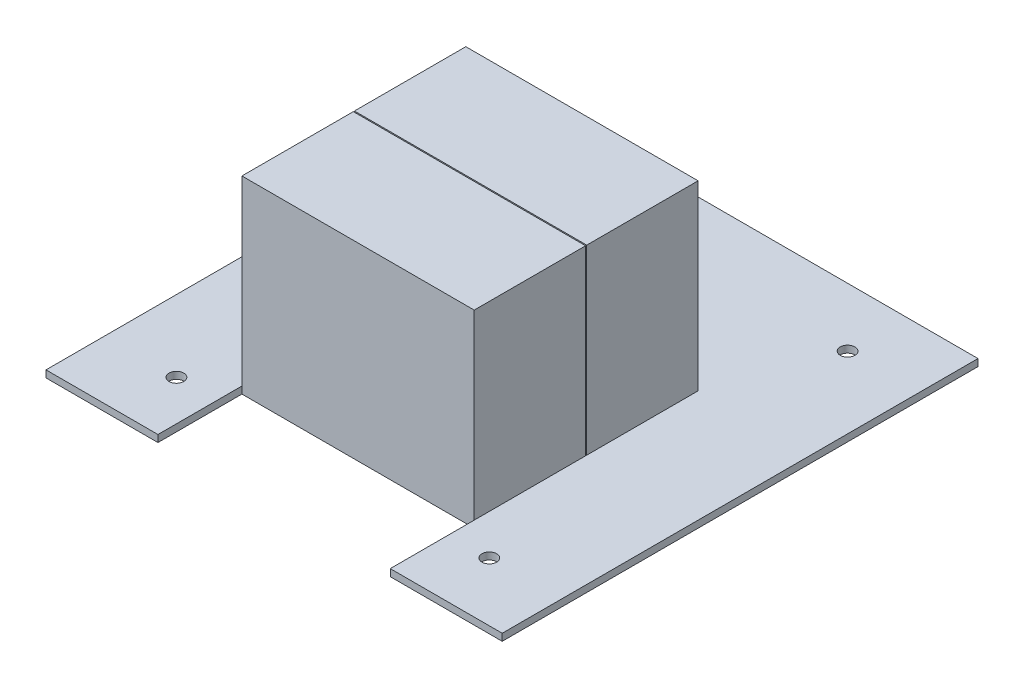
ISO-10303-21;
HEADER;
FILE_DESCRIPTION(('STEP AP214'),'2;1');
FILE_NAME('part.step','',(''),(''),'','','');
FILE_SCHEMA(('AUTOMOTIVE_DESIGN { 1 0 10303 214 1 1 1 1 }'));
ENDSEC;
DATA;
#1=APPLICATION_CONTEXT('core data for automotive mechanical design processes');
#2=APPLICATION_PROTOCOL_DEFINITION('international standard','automotive_design',2000,#1);
#3=PRODUCT_CONTEXT('',#1,'mechanical');
#4=PRODUCT('Part','Part','',(#3));
#5=PRODUCT_RELATED_PRODUCT_CATEGORY('part','',(#4));
#6=PRODUCT_DEFINITION_FORMATION('','',#4);
#7=PRODUCT_DEFINITION_CONTEXT('part definition',#1,'design');
#8=PRODUCT_DEFINITION('design','',#6,#7);
#9=PRODUCT_DEFINITION_SHAPE('','',#8);
#10=(LENGTH_UNIT() NAMED_UNIT(*) SI_UNIT(.MILLI.,.METRE.));
#11=(NAMED_UNIT(*) PLANE_ANGLE_UNIT() SI_UNIT($,.RADIAN.));
#12=(NAMED_UNIT(*) SI_UNIT($,.STERADIAN.) SOLID_ANGLE_UNIT());
#13=UNCERTAINTY_MEASURE_WITH_UNIT(LENGTH_MEASURE(1.E-05),#10,'distance_accuracy_value','');
#14=(GEOMETRIC_REPRESENTATION_CONTEXT(3) GLOBAL_UNCERTAINTY_ASSIGNED_CONTEXT((#13)) GLOBAL_UNIT_ASSIGNED_CONTEXT((#10,
#11,#12)) REPRESENTATION_CONTEXT('',''));
#15=CARTESIAN_POINT('',(0.,0.,0.));
#16=DIRECTION('',(0.,0.,1.));
#17=DIRECTION('',(1.,0.,0.));
#18=AXIS2_PLACEMENT_3D('',#15,#16,#17);
#19=CARTESIAN_POINT('',(41.5,67.5,-25.));
#20=DIRECTION('',(-1.,0.,0.));
#21=DIRECTION('',(0.,0.,1.));
#22=AXIS2_PLACEMENT_3D('',#19,#20,#21);
#23=PLANE('',#22);
#24=DIRECTION('',(0.,0.,-1.));
#25=VECTOR('',#24,1.);
#26=CARTESIAN_POINT('',(41.5,2.5,-25.));
#27=LINE('',#26,#25);
#28=CARTESIAN_POINT('',(41.5,2.5,55.));
#29=VERTEX_POINT('',#28);
#30=CARTESIAN_POINT('',(41.5,2.5,15.2));
#31=VERTEX_POINT('',#30);
#32=EDGE_CURVE('E210',#29,#31,#27,.T.);
#33=ORIENTED_EDGE('',*,*,#32,.T.);
#34=DIRECTION('',(0.,1.,0.));
#35=VECTOR('',#34,1.);
#36=CARTESIAN_POINT('',(41.5,0.,15.2));
#37=LINE('',#36,#35);
#38=CARTESIAN_POINT('',(41.5,67.5,15.2));
#39=VERTEX_POINT('',#38);
#40=EDGE_CURVE('E188',#31,#39,#37,.T.);
#41=ORIENTED_EDGE('',*,*,#40,.T.);
#42=DIRECTION('',(0.,0.,-1.));
#43=VECTOR('',#42,1.);
#44=CARTESIAN_POINT('',(41.5,67.5,-25.));
#45=LINE('',#44,#43);
#46=CARTESIAN_POINT('',(41.5,67.5,55.));
#47=VERTEX_POINT('',#46);
#48=EDGE_CURVE('E197',#47,#39,#45,.T.);
#49=ORIENTED_EDGE('',*,*,#48,.F.);
#50=DIRECTION('',(0.,-1.,0.));
#51=VECTOR('',#50,1.);
#52=CARTESIAN_POINT('',(41.5,67.5,55.));
#53=LINE('',#52,#51);
#54=EDGE_CURVE('E209',#47,#29,#53,.T.);
#55=ORIENTED_EDGE('',*,*,#54,.T.);
#56=EDGE_LOOP('',(#33,#41,#49,#55));
#57=FACE_BOUND('',#56,.T.);
#58=ADVANCED_FACE('F36',(#57),#23,.F.);
#59=CARTESIAN_POINT('',(-41.5,67.5,-25.));
#60=DIRECTION('',(1.,0.,0.));
#61=DIRECTION('',(0.,0.,-1.));
#62=AXIS2_PLACEMENT_3D('',#59,#60,#61);
#63=PLANE('',#62);
#64=DIRECTION('',(0.,0.,1.));
#65=VECTOR('',#64,1.);
#66=CARTESIAN_POINT('',(-41.5,67.5,-25.));
#67=LINE('',#66,#65);
#68=CARTESIAN_POINT('',(-41.5,67.5,15.2));
#69=VERTEX_POINT('',#68);
#70=CARTESIAN_POINT('',(-41.5,67.5,55.));
#71=VERTEX_POINT('',#70);
#72=EDGE_CURVE('E203',#69,#71,#67,.T.);
#73=ORIENTED_EDGE('',*,*,#72,.F.);
#74=DIRECTION('',(0.,1.,0.));
#75=VECTOR('',#74,1.);
#76=CARTESIAN_POINT('',(-41.5,0.,15.2));
#77=LINE('',#76,#75);
#78=CARTESIAN_POINT('',(-41.5,2.5,15.2));
#79=VERTEX_POINT('',#78);
#80=EDGE_CURVE('E192',#79,#69,#77,.T.);
#81=ORIENTED_EDGE('',*,*,#80,.F.);
#82=DIRECTION('',(0.,0.,1.));
#83=VECTOR('',#82,1.);
#84=CARTESIAN_POINT('',(-41.5,2.5,-25.));
#85=LINE('',#84,#83);
#86=CARTESIAN_POINT('',(-41.5,2.5,55.));
#87=VERTEX_POINT('',#86);
#88=EDGE_CURVE('E216',#79,#87,#85,.T.);
#89=ORIENTED_EDGE('',*,*,#88,.T.);
#90=DIRECTION('',(0.,-1.,0.));
#91=VECTOR('',#90,1.);
#92=CARTESIAN_POINT('',(-41.5,67.5,55.));
#93=LINE('',#92,#91);
#94=EDGE_CURVE('E222',#71,#87,#93,.T.);
#95=ORIENTED_EDGE('',*,*,#94,.F.);
#96=EDGE_LOOP('',(#73,#81,#89,#95));
#97=FACE_BOUND('',#96,.T.);
#98=ADVANCED_FACE('F312',(#97),#63,.F.);
#99=CARTESIAN_POINT('',(0.,67.5,0.));
#100=DIRECTION('',(0.,1.,0.));
#101=DIRECTION('',(0.,0.,1.));
#102=AXIS2_PLACEMENT_3D('',#99,#100,#101);
#103=PLANE('',#102);
#104=DIRECTION('',(1.,0.,0.));
#105=VECTOR('',#104,1.);
#106=CARTESIAN_POINT('',(0.,67.5,15.2));
#107=LINE('',#106,#105);
#108=EDGE_CURVE('E11',#69,#39,#107,.T.);
#109=ORIENTED_EDGE('',*,*,#108,.F.);
#110=ORIENTED_EDGE('',*,*,#72,.T.);
#111=DIRECTION('',(1.,0.,0.));
#112=VECTOR('',#111,1.);
#113=CARTESIAN_POINT('',(-41.5,67.5,55.));
#114=LINE('',#113,#112);
#115=EDGE_CURVE('E207',#71,#47,#114,.T.);
#116=ORIENTED_EDGE('',*,*,#115,.T.);
#117=ORIENTED_EDGE('',*,*,#48,.T.);
#118=EDGE_LOOP('',(#109,#110,#116,#117));
#119=FACE_BOUND('',#118,.T.);
#120=ADVANCED_FACE('F316',(#119),#103,.T.);
#121=CARTESIAN_POINT('',(81.5,2.5,-85.));
#122=DIRECTION('',(-1.,0.,0.));
#123=DIRECTION('',(0.,0.,1.));
#124=AXIS2_PLACEMENT_3D('',#121,#122,#123);
#125=PLANE('',#124);
#126=DIRECTION('',(0.,0.,-1.));
#127=VECTOR('',#126,1.);
#128=CARTESIAN_POINT('',(81.5,0.,-85.));
#129=LINE('',#128,#127);
#130=CARTESIAN_POINT('',(81.5,0.,85.));
#131=VERTEX_POINT('',#130);
#132=CARTESIAN_POINT('',(81.5,0.,-85.));
#133=VERTEX_POINT('',#132);
#134=EDGE_CURVE('E231',#131,#133,#129,.T.);
#135=ORIENTED_EDGE('',*,*,#134,.T.);
#136=DIRECTION('',(0.,-1.,0.));
#137=VECTOR('',#136,1.);
#138=CARTESIAN_POINT('',(81.5,2.5,-85.));
#139=LINE('',#138,#137);
#140=CARTESIAN_POINT('',(81.5,2.5,-85.));
#141=VERTEX_POINT('',#140);
#142=EDGE_CURVE('E285',#141,#133,#139,.T.);
#143=ORIENTED_EDGE('',*,*,#142,.F.);
#144=DIRECTION('',(0.,0.,-1.));
#145=VECTOR('',#144,1.);
#146=CARTESIAN_POINT('',(81.5,2.5,-85.));
#147=LINE('',#146,#145);
#148=CARTESIAN_POINT('',(81.5,2.5,85.));
#149=VERTEX_POINT('',#148);
#150=EDGE_CURVE('E232',#149,#141,#147,.T.);
#151=ORIENTED_EDGE('',*,*,#150,.F.);
#152=DIRECTION('',(0.,-1.,0.));
#153=VECTOR('',#152,1.);
#154=CARTESIAN_POINT('',(81.5,2.5,85.));
#155=LINE('',#154,#153);
#156=EDGE_CURVE('E249',#149,#131,#155,.T.);
#157=ORIENTED_EDGE('',*,*,#156,.T.);
#158=EDGE_LOOP('',(#135,#143,#151,#157));
#159=FACE_BOUND('',#158,.T.);
#160=ADVANCED_FACE('F38',(#159),#125,.F.);
#161=CARTESIAN_POINT('',(-81.5,2.5,-85.));
#162=DIRECTION('',(0.,0.,1.));
#163=DIRECTION('',(1.,0.,0.));
#164=AXIS2_PLACEMENT_3D('',#161,#162,#163);
#165=PLANE('',#164);
#166=DIRECTION('',(-1.,0.,0.));
#167=VECTOR('',#166,1.);
#168=CARTESIAN_POINT('',(-81.5,0.,-85.));
#169=LINE('',#168,#167);
#170=CARTESIAN_POINT('',(-81.5,0.,-85.));
#171=VERTEX_POINT('',#170);
#172=EDGE_CURVE('E252',#133,#171,#169,.T.);
#173=ORIENTED_EDGE('',*,*,#172,.T.);
#174=DIRECTION('',(0.,-1.,0.));
#175=VECTOR('',#174,1.);
#176=CARTESIAN_POINT('',(-81.5,2.5,-85.));
#177=LINE('',#176,#175);
#178=CARTESIAN_POINT('',(-81.5,2.5,-85.));
#179=VERTEX_POINT('',#178);
#180=EDGE_CURVE('E282',#179,#171,#177,.T.);
#181=ORIENTED_EDGE('',*,*,#180,.F.);
#182=DIRECTION('',(-1.,0.,0.));
#183=VECTOR('',#182,1.);
#184=CARTESIAN_POINT('',(-81.5,2.5,-85.));
#185=LINE('',#184,#183);
#186=EDGE_CURVE('E235',#141,#179,#185,.T.);
#187=ORIENTED_EDGE('',*,*,#186,.F.);
#188=ORIENTED_EDGE('',*,*,#142,.T.);
#189=EDGE_LOOP('',(#173,#181,#187,#188));
#190=FACE_BOUND('',#189,.T.);
#191=ADVANCED_FACE('F341',(#190),#165,.F.);
#192=CARTESIAN_POINT('',(-81.5,2.5,-85.));
#193=DIRECTION('',(1.,0.,0.));
#194=DIRECTION('',(0.,0.,-1.));
#195=AXIS2_PLACEMENT_3D('',#192,#193,#194);
#196=PLANE('',#195);
#197=DIRECTION('',(0.,0.,1.));
#198=VECTOR('',#197,1.);
#199=CARTESIAN_POINT('',(-81.5,0.,-85.));
#200=LINE('',#199,#198);
#201=CARTESIAN_POINT('',(-81.5,0.,85.));
#202=VERTEX_POINT('',#201);
#203=EDGE_CURVE('E254',#171,#202,#200,.T.);
#204=ORIENTED_EDGE('',*,*,#203,.T.);
#205=DIRECTION('',(0.,-1.,0.));
#206=VECTOR('',#205,1.);
#207=CARTESIAN_POINT('',(-81.5,2.5,85.));
#208=LINE('',#207,#206);
#209=CARTESIAN_POINT('',(-81.5,2.5,85.));
#210=VERTEX_POINT('',#209);
#211=EDGE_CURVE('E279',#210,#202,#208,.T.);
#212=ORIENTED_EDGE('',*,*,#211,.F.);
#213=DIRECTION('',(0.,0.,1.));
#214=VECTOR('',#213,1.);
#215=CARTESIAN_POINT('',(-81.5,2.5,-85.));
#216=LINE('',#215,#214);
#217=EDGE_CURVE('E238',#179,#210,#216,.T.);
#218=ORIENTED_EDGE('',*,*,#217,.F.);
#219=ORIENTED_EDGE('',*,*,#180,.T.);
#220=EDGE_LOOP('',(#204,#212,#218,#219));
#221=FACE_BOUND('',#220,.T.);
#222=ADVANCED_FACE('F346',(#221),#196,.F.);
#223=CARTESIAN_POINT('',(-81.5,2.5,85.));
#224=DIRECTION('',(0.,0.,-1.));
#225=DIRECTION('',(-1.,0.,0.));
#226=AXIS2_PLACEMENT_3D('',#223,#224,#225);
#227=PLANE('',#226);
#228=DIRECTION('',(1.,0.,0.));
#229=VECTOR('',#228,1.);
#230=CARTESIAN_POINT('',(-81.5,0.,85.));
#231=LINE('',#230,#229);
#232=CARTESIAN_POINT('',(-41.5,0.,85.));
#233=VERTEX_POINT('',#232);
#234=EDGE_CURVE('E256',#202,#233,#231,.T.);
#235=ORIENTED_EDGE('',*,*,#234,.T.);
#236=DIRECTION('',(0.,-1.,0.));
#237=VECTOR('',#236,1.);
#238=CARTESIAN_POINT('',(-41.5,2.5,85.));
#239=LINE('',#238,#237);
#240=CARTESIAN_POINT('',(-41.5,2.5,85.));
#241=VERTEX_POINT('',#240);
#242=EDGE_CURVE('E276',#241,#233,#239,.T.);
#243=ORIENTED_EDGE('',*,*,#242,.F.);
#244=DIRECTION('',(1.,0.,0.));
#245=VECTOR('',#244,1.);
#246=CARTESIAN_POINT('',(-81.5,2.5,85.));
#247=LINE('',#246,#245);
#248=EDGE_CURVE('E240',#210,#241,#247,.T.);
#249=ORIENTED_EDGE('',*,*,#248,.F.);
#250=ORIENTED_EDGE('',*,*,#211,.T.);
#251=EDGE_LOOP('',(#235,#243,#249,#250));
#252=FACE_BOUND('',#251,.T.);
#253=ADVANCED_FACE('F352',(#252),#227,.F.);
#254=CARTESIAN_POINT('',(-41.5,2.5,55.));
#255=DIRECTION('',(-1.,0.,0.));
#256=DIRECTION('',(0.,0.,1.));
#257=AXIS2_PLACEMENT_3D('',#254,#255,#256);
#258=PLANE('',#257);
#259=DIRECTION('',(0.,0.,-1.));
#260=VECTOR('',#259,1.);
#261=CARTESIAN_POINT('',(-41.5,0.,55.));
#262=LINE('',#261,#260);
#263=CARTESIAN_POINT('',(-41.5,0.,55.));
#264=VERTEX_POINT('',#263);
#265=EDGE_CURVE('E258',#233,#264,#262,.T.);
#266=ORIENTED_EDGE('',*,*,#265,.T.);
#267=DIRECTION('',(0.,-1.,0.));
#268=VECTOR('',#267,1.);
#269=CARTESIAN_POINT('',(-41.5,2.5,55.));
#270=LINE('',#269,#268);
#271=EDGE_CURVE('E273',#87,#264,#270,.T.);
#272=ORIENTED_EDGE('',*,*,#271,.F.);
#273=DIRECTION('',(0.,0.,-1.));
#274=VECTOR('',#273,1.);
#275=CARTESIAN_POINT('',(-41.5,2.5,55.));
#276=LINE('',#275,#274);
#277=EDGE_CURVE('E242',#241,#87,#276,.T.);
#278=ORIENTED_EDGE('',*,*,#277,.F.);
#279=ORIENTED_EDGE('',*,*,#242,.T.);
#280=EDGE_LOOP('',(#266,#272,#278,#279));
#281=FACE_BOUND('',#280,.T.);
#282=ADVANCED_FACE('F356',(#281),#258,.F.);
#283=CARTESIAN_POINT('',(41.5,2.5,55.));
#284=DIRECTION('',(0.,0.,-1.));
#285=DIRECTION('',(-1.,0.,0.));
#286=AXIS2_PLACEMENT_3D('',#283,#284,#285);
#287=PLANE('',#286);
#288=DIRECTION('',(1.,0.,0.));
#289=VECTOR('',#288,1.);
#290=CARTESIAN_POINT('',(41.5,0.,55.));
#291=LINE('',#290,#289);
#292=CARTESIAN_POINT('',(41.5,0.,55.));
#293=VERTEX_POINT('',#292);
#294=EDGE_CURVE('E260',#264,#293,#291,.T.);
#295=ORIENTED_EDGE('',*,*,#294,.T.);
#296=DIRECTION('',(0.,-1.,0.));
#297=VECTOR('',#296,1.);
#298=CARTESIAN_POINT('',(41.5,2.5,55.));
#299=LINE('',#298,#297);
#300=EDGE_CURVE('E270',#29,#293,#299,.T.);
#301=ORIENTED_EDGE('',*,*,#300,.F.);
#302=ORIENTED_EDGE('',*,*,#54,.F.);
#303=ORIENTED_EDGE('',*,*,#115,.F.);
#304=ORIENTED_EDGE('',*,*,#94,.T.);
#305=ORIENTED_EDGE('',*,*,#271,.T.);
#306=EDGE_LOOP('',(#295,#301,#302,#303,#304,#305));
#307=FACE_BOUND('',#306,.T.);
#308=ADVANCED_FACE('F325',(#307),#287,.F.);
#309=CARTESIAN_POINT('',(41.5,2.5,85.));
#310=DIRECTION('',(1.,0.,0.));
#311=DIRECTION('',(0.,0.,-1.));
#312=AXIS2_PLACEMENT_3D('',#309,#310,#311);
#313=PLANE('',#312);
#314=DIRECTION('',(0.,0.,1.));
#315=VECTOR('',#314,1.);
#316=CARTESIAN_POINT('',(41.5,0.,85.));
#317=LINE('',#316,#315);
#318=CARTESIAN_POINT('',(41.5,0.,85.));
#319=VERTEX_POINT('',#318);
#320=EDGE_CURVE('E262',#293,#319,#317,.T.);
#321=ORIENTED_EDGE('',*,*,#320,.T.);
#322=DIRECTION('',(0.,-1.,0.));
#323=VECTOR('',#322,1.);
#324=CARTESIAN_POINT('',(41.5,2.5,85.));
#325=LINE('',#324,#323);
#326=CARTESIAN_POINT('',(41.5,2.5,85.));
#327=VERTEX_POINT('',#326);
#328=EDGE_CURVE('E267',#327,#319,#325,.T.);
#329=ORIENTED_EDGE('',*,*,#328,.F.);
#330=DIRECTION('',(0.,0.,1.));
#331=VECTOR('',#330,1.);
#332=CARTESIAN_POINT('',(41.5,2.5,85.));
#333=LINE('',#332,#331);
#334=EDGE_CURVE('E245',#29,#327,#333,.T.);
#335=ORIENTED_EDGE('',*,*,#334,.F.);
#336=ORIENTED_EDGE('',*,*,#300,.T.);
#337=EDGE_LOOP('',(#321,#329,#335,#336));
#338=FACE_BOUND('',#337,.T.);
#339=ADVANCED_FACE('F329',(#338),#313,.F.);
#340=CARTESIAN_POINT('',(41.5,2.5,85.));
#341=DIRECTION('',(0.,0.,-1.));
#342=DIRECTION('',(-1.,0.,0.));
#343=AXIS2_PLACEMENT_3D('',#340,#341,#342);
#344=PLANE('',#343);
#345=DIRECTION('',(1.,0.,0.));
#346=VECTOR('',#345,1.);
#347=CARTESIAN_POINT('',(41.5,0.,85.));
#348=LINE('',#347,#346);
#349=EDGE_CURVE('E236',#319,#131,#348,.T.);
#350=ORIENTED_EDGE('',*,*,#349,.T.);
#351=ORIENTED_EDGE('',*,*,#156,.F.);
#352=DIRECTION('',(1.,0.,0.));
#353=VECTOR('',#352,1.);
#354=CARTESIAN_POINT('',(41.5,2.5,85.));
#355=LINE('',#354,#353);
#356=EDGE_CURVE('E247',#327,#149,#355,.T.);
#357=ORIENTED_EDGE('',*,*,#356,.F.);
#358=ORIENTED_EDGE('',*,*,#328,.T.);
#359=EDGE_LOOP('',(#350,#351,#357,#358));
#360=FACE_BOUND('',#359,.T.);
#361=ADVANCED_FACE('F334',(#360),#344,.F.);
#362=CARTESIAN_POINT('',(0.,2.5,0.));
#363=DIRECTION('',(0.,1.,0.));
#364=DIRECTION('',(0.,0.,1.));
#365=AXIS2_PLACEMENT_3D('',#362,#363,#364);
#366=PLANE('',#365);
#367=CARTESIAN_POINT('',(55.9,2.5,64.));
#368=DIRECTION('',(0.,1.,0.));
#369=DIRECTION('',(0.,0.,1.));
#370=AXIS2_PLACEMENT_3D('',#367,#368,#369);
#371=CIRCLE('',#370,2.625);
#372=CARTESIAN_POINT('',(55.9,2.5,66.625));
#373=VERTEX_POINT('',#372);
#374=EDGE_CURVE('E176',#373,#373,#371,.F.);
#375=ORIENTED_EDGE('',*,*,#374,.T.);
#376=EDGE_LOOP('',(#375));
#377=FACE_BOUND('',#376,.T.);
#378=CARTESIAN_POINT('',(-55.9,2.5,-64.));
#379=DIRECTION('',(0.,1.,0.));
#380=DIRECTION('',(0.,0.,1.));
#381=AXIS2_PLACEMENT_3D('',#378,#379,#380);
#382=CIRCLE('',#381,2.625);
#383=CARTESIAN_POINT('',(-55.9,2.5,-61.375));
#384=VERTEX_POINT('',#383);
#385=EDGE_CURVE('E179',#384,#384,#382,.F.);
#386=ORIENTED_EDGE('',*,*,#385,.T.);
#387=EDGE_LOOP('',(#386));
#388=FACE_BOUND('',#387,.T.);
#389=CARTESIAN_POINT('',(55.9,2.5,-64.));
#390=DIRECTION('',(0.,1.,0.));
#391=DIRECTION('',(0.,0.,1.));
#392=AXIS2_PLACEMENT_3D('',#389,#390,#391);
#393=CIRCLE('',#392,2.625);
#394=CARTESIAN_POINT('',(55.9,2.5,-61.375));
#395=VERTEX_POINT('',#394);
#396=EDGE_CURVE('E411',#395,#395,#393,.F.);
#397=ORIENTED_EDGE('',*,*,#396,.T.);
#398=EDGE_LOOP('',(#397));
#399=FACE_BOUND('',#398,.T.);
#400=CARTESIAN_POINT('',(-55.9,2.5,64.));
#401=DIRECTION('',(0.,1.,0.));
#402=DIRECTION('',(0.,0.,1.));
#403=AXIS2_PLACEMENT_3D('',#400,#401,#402);
#404=CIRCLE('',#403,2.625);
#405=CARTESIAN_POINT('',(-55.9,2.5,66.625));
#406=VERTEX_POINT('',#405);
#407=EDGE_CURVE('E426',#406,#406,#404,.F.);
#408=ORIENTED_EDGE('',*,*,#407,.T.);
#409=EDGE_LOOP('',(#408));
#410=FACE_BOUND('',#409,.T.);
#411=ORIENTED_EDGE('',*,*,#32,.F.);
#412=ORIENTED_EDGE('',*,*,#334,.T.);
#413=ORIENTED_EDGE('',*,*,#356,.T.);
#414=ORIENTED_EDGE('',*,*,#150,.T.);
#415=ORIENTED_EDGE('',*,*,#186,.T.);
#416=ORIENTED_EDGE('',*,*,#217,.T.);
#417=ORIENTED_EDGE('',*,*,#248,.T.);
#418=ORIENTED_EDGE('',*,*,#277,.T.);
#419=ORIENTED_EDGE('',*,*,#88,.F.);
#420=DIRECTION('',(-1.38777878078149E-13,0.,1.));
#421=VECTOR('',#420,1.);
#422=CARTESIAN_POINT('',(-41.4999999999979,2.5,-5.7592819402429E-12));
#423=LINE('',#422,#421);
#424=CARTESIAN_POINT('',(-41.5,2.5,14.8));
#425=VERTEX_POINT('',#424);
#426=EDGE_CURVE('E187',#425,#79,#423,.T.);
#427=ORIENTED_EDGE('',*,*,#426,.F.);
#428=CARTESIAN_POINT('',(-41.5,2.5,-25.));
#429=VERTEX_POINT('',#428);
#430=EDGE_CURVE('E217',#429,#425,#85,.T.);
#431=ORIENTED_EDGE('',*,*,#430,.F.);
#432=DIRECTION('',(-1.,0.,0.));
#433=VECTOR('',#432,1.);
#434=CARTESIAN_POINT('',(-41.5,2.5,-25.));
#435=LINE('',#434,#433);
#436=CARTESIAN_POINT('',(41.5,2.5,-25.));
#437=VERTEX_POINT('',#436);
#438=EDGE_CURVE('E213',#437,#429,#435,.T.);
#439=ORIENTED_EDGE('',*,*,#438,.F.);
#440=CARTESIAN_POINT('',(41.5,2.5,14.8));
#441=VERTEX_POINT('',#440);
#442=EDGE_CURVE('E196',#441,#437,#27,.T.);
#443=ORIENTED_EDGE('',*,*,#442,.F.);
#444=DIRECTION('',(0.,0.,-1.));
#445=VECTOR('',#444,1.);
#446=CARTESIAN_POINT('',(41.5,2.5,0.));
#447=LINE('',#446,#445);
#448=EDGE_CURVE('E163',#31,#441,#447,.T.);
#449=ORIENTED_EDGE('',*,*,#448,.F.);
#450=EDGE_LOOP('',(#411,#412,#413,#414,#415,#416,#417,#418,#419,#427,#431,#439,#443,#449));
#451=FACE_BOUND('',#450,.T.);
#452=ADVANCED_FACE('F302',(#377,#388,#399,#410,#451),#366,.T.);
#453=CARTESIAN_POINT('',(0.,0.,0.));
#454=DIRECTION('',(0.,1.,0.));
#455=DIRECTION('',(0.,0.,1.));
#456=AXIS2_PLACEMENT_3D('',#453,#454,#455);
#457=PLANE('',#456);
#458=CARTESIAN_POINT('',(55.9,0.,64.));
#459=DIRECTION('',(0.,1.,0.));
#460=DIRECTION('',(0.,0.,1.));
#461=AXIS2_PLACEMENT_3D('',#458,#459,#460);
#462=CIRCLE('',#461,2.625);
#463=CARTESIAN_POINT('',(55.9,0.,66.625));
#464=VERTEX_POINT('',#463);
#465=EDGE_CURVE('E419',#464,#464,#462,.T.);
#466=ORIENTED_EDGE('',*,*,#465,.T.);
#467=EDGE_LOOP('',(#466));
#468=FACE_BOUND('',#467,.T.);
#469=CARTESIAN_POINT('',(-55.9,0.,-64.));
#470=DIRECTION('',(0.,1.,0.));
#471=DIRECTION('',(0.,0.,1.));
#472=AXIS2_PLACEMENT_3D('',#469,#470,#471);
#473=CIRCLE('',#472,2.625);
#474=CARTESIAN_POINT('',(-55.9,0.,-61.375));
#475=VERTEX_POINT('',#474);
#476=EDGE_CURVE('E416',#475,#475,#473,.T.);
#477=ORIENTED_EDGE('',*,*,#476,.T.);
#478=EDGE_LOOP('',(#477));
#479=FACE_BOUND('',#478,.T.);
#480=CARTESIAN_POINT('',(55.9,0.,-64.));
#481=DIRECTION('',(0.,1.,0.));
#482=DIRECTION('',(0.,0.,1.));
#483=AXIS2_PLACEMENT_3D('',#480,#481,#482);
#484=CIRCLE('',#483,2.625);
#485=CARTESIAN_POINT('',(55.9,0.,-61.375));
#486=VERTEX_POINT('',#485);
#487=EDGE_CURVE('E414',#486,#486,#484,.T.);
#488=ORIENTED_EDGE('',*,*,#487,.T.);
#489=EDGE_LOOP('',(#488));
#490=FACE_BOUND('',#489,.T.);
#491=CARTESIAN_POINT('',(-55.9,0.,64.));
#492=DIRECTION('',(0.,1.,0.));
#493=DIRECTION('',(0.,0.,1.));
#494=AXIS2_PLACEMENT_3D('',#491,#492,#493);
#495=CIRCLE('',#494,2.625);
#496=CARTESIAN_POINT('',(-55.9,0.,66.625));
#497=VERTEX_POINT('',#496);
#498=EDGE_CURVE('E422',#497,#497,#495,.T.);
#499=ORIENTED_EDGE('',*,*,#498,.T.);
#500=EDGE_LOOP('',(#499));
#501=FACE_BOUND('',#500,.T.);
#502=DIRECTION('',(1.,0.,0.));
#503=VECTOR('',#502,1.);
#504=CARTESIAN_POINT('',(41.5,0.,15.2));
#505=LINE('',#504,#503);
#506=CARTESIAN_POINT('',(-41.5,0.,15.2));
#507=VERTEX_POINT('',#506);
#508=CARTESIAN_POINT('',(41.5,0.,15.2));
#509=VERTEX_POINT('',#508);
#510=EDGE_CURVE('E175',#507,#509,#505,.T.);
#511=ORIENTED_EDGE('',*,*,#510,.T.);
#512=DIRECTION('',(0.,0.,-1.));
#513=VECTOR('',#512,1.);
#514=CARTESIAN_POINT('',(41.5,0.,14.8));
#515=LINE('',#514,#513);
#516=CARTESIAN_POINT('',(41.5,0.,14.8));
#517=VERTEX_POINT('',#516);
#518=EDGE_CURVE('E160',#509,#517,#515,.T.);
#519=ORIENTED_EDGE('',*,*,#518,.T.);
#520=DIRECTION('',(-1.,0.,0.));
#521=VECTOR('',#520,1.);
#522=CARTESIAN_POINT('',(-41.5,0.,14.8));
#523=LINE('',#522,#521);
#524=CARTESIAN_POINT('',(-41.5,0.,14.8));
#525=VERTEX_POINT('',#524);
#526=EDGE_CURVE('E167',#517,#525,#523,.T.);
#527=ORIENTED_EDGE('',*,*,#526,.T.);
#528=DIRECTION('',(1.38777878078139E-13,0.,1.));
#529=VECTOR('',#528,1.);
#530=CARTESIAN_POINT('',(-41.5,0.,15.));
#531=LINE('',#530,#529);
#532=EDGE_CURVE('E51',#525,#507,#531,.T.);
#533=ORIENTED_EDGE('',*,*,#532,.T.);
#534=EDGE_LOOP('',(#511,#519,#527,#533));
#535=FACE_BOUND('',#534,.T.);
#536=ORIENTED_EDGE('',*,*,#134,.F.);
#537=ORIENTED_EDGE('',*,*,#349,.F.);
#538=ORIENTED_EDGE('',*,*,#320,.F.);
#539=ORIENTED_EDGE('',*,*,#294,.F.);
#540=ORIENTED_EDGE('',*,*,#265,.F.);
#541=ORIENTED_EDGE('',*,*,#234,.F.);
#542=ORIENTED_EDGE('',*,*,#203,.F.);
#543=ORIENTED_EDGE('',*,*,#172,.F.);
#544=EDGE_LOOP('',(#536,#537,#538,#539,#540,#541,#542,#543));
#545=FACE_BOUND('',#544,.T.);
#546=ADVANCED_FACE('F172',(#468,#479,#490,#501,#535,#545),#457,.F.);
#547=CARTESIAN_POINT('',(41.5,67.5,14.8));
#548=VERTEX_POINT('',#547);
#549=CARTESIAN_POINT('',(41.5,67.5,-25.));
#550=VERTEX_POINT('',#549);
#551=EDGE_CURVE('E201',#548,#550,#45,.T.);
#552=ORIENTED_EDGE('',*,*,#551,.F.);
#553=DIRECTION('',(0.,1.,0.));
#554=VECTOR('',#553,1.);
#555=CARTESIAN_POINT('',(41.5,0.,14.8));
#556=LINE('',#555,#554);
#557=EDGE_CURVE('E59',#441,#548,#556,.T.);
#558=ORIENTED_EDGE('',*,*,#557,.F.);
#559=ORIENTED_EDGE('',*,*,#442,.T.);
#560=DIRECTION('',(0.,-1.,0.));
#561=VECTOR('',#560,1.);
#562=CARTESIAN_POINT('',(41.5,67.5,-25.));
#563=LINE('',#562,#561);
#564=EDGE_CURVE('E228',#550,#437,#563,.T.);
#565=ORIENTED_EDGE('',*,*,#564,.F.);
#566=EDGE_LOOP('',(#552,#558,#559,#565));
#567=FACE_BOUND('',#566,.T.);
#568=ADVANCED_FACE('F358',(#567),#23,.F.);
#569=CARTESIAN_POINT('',(-41.5,67.5,-25.));
#570=DIRECTION('',(0.,0.,1.));
#571=DIRECTION('',(1.,0.,0.));
#572=AXIS2_PLACEMENT_3D('',#569,#570,#571);
#573=PLANE('',#572);
#574=ORIENTED_EDGE('',*,*,#438,.T.);
#575=DIRECTION('',(0.,-1.,0.));
#576=VECTOR('',#575,1.);
#577=CARTESIAN_POINT('',(-41.5,67.5,-25.));
#578=LINE('',#577,#576);
#579=CARTESIAN_POINT('',(-41.5,67.5,-25.));
#580=VERTEX_POINT('',#579);
#581=EDGE_CURVE('E225',#580,#429,#578,.T.);
#582=ORIENTED_EDGE('',*,*,#581,.F.);
#583=DIRECTION('',(-1.,0.,0.));
#584=VECTOR('',#583,1.);
#585=CARTESIAN_POINT('',(-41.5,67.5,-25.));
#586=LINE('',#585,#584);
#587=EDGE_CURVE('E200',#550,#580,#586,.T.);
#588=ORIENTED_EDGE('',*,*,#587,.F.);
#589=ORIENTED_EDGE('',*,*,#564,.T.);
#590=EDGE_LOOP('',(#574,#582,#588,#589));
#591=FACE_BOUND('',#590,.T.);
#592=ADVANCED_FACE('F298',(#591),#573,.F.);
#593=ORIENTED_EDGE('',*,*,#430,.T.);
#594=DIRECTION('',(0.,1.,0.));
#595=VECTOR('',#594,1.);
#596=CARTESIAN_POINT('',(-41.5,0.,14.8));
#597=LINE('',#596,#595);
#598=CARTESIAN_POINT('',(-41.5,67.5,14.8));
#599=VERTEX_POINT('',#598);
#600=EDGE_CURVE('E164',#425,#599,#597,.T.);
#601=ORIENTED_EDGE('',*,*,#600,.T.);
#602=EDGE_CURVE('E204',#580,#599,#67,.T.);
#603=ORIENTED_EDGE('',*,*,#602,.F.);
#604=ORIENTED_EDGE('',*,*,#581,.T.);
#605=EDGE_LOOP('',(#593,#601,#603,#604));
#606=FACE_BOUND('',#605,.T.);
#607=ADVANCED_FACE('F292',(#606),#63,.F.);
#608=DIRECTION('',(-1.,0.,0.));
#609=VECTOR('',#608,1.);
#610=CARTESIAN_POINT('',(0.,67.5,14.8));
#611=LINE('',#610,#609);
#612=EDGE_CURVE('E44',#548,#599,#611,.T.);
#613=ORIENTED_EDGE('',*,*,#612,.F.);
#614=ORIENTED_EDGE('',*,*,#551,.T.);
#615=ORIENTED_EDGE('',*,*,#587,.T.);
#616=ORIENTED_EDGE('',*,*,#602,.T.);
#617=EDGE_LOOP('',(#613,#614,#615,#616));
#618=FACE_BOUND('',#617,.T.);
#619=ADVANCED_FACE('F293',(#618),#103,.T.);
#620=CARTESIAN_POINT('',(41.5,0.,14.8));
#621=DIRECTION('',(1.,0.,0.));
#622=DIRECTION('',(0.,0.,-1.));
#623=AXIS2_PLACEMENT_3D('',#620,#621,#622);
#624=PLANE('',#623);
#625=ORIENTED_EDGE('',*,*,#448,.T.);
#626=EDGE_CURVE('E155',#517,#441,#556,.T.);
#627=ORIENTED_EDGE('',*,*,#626,.F.);
#628=ORIENTED_EDGE('',*,*,#518,.F.);
#629=EDGE_CURVE('E185',#509,#31,#37,.T.);
#630=ORIENTED_EDGE('',*,*,#629,.T.);
#631=EDGE_LOOP('',(#625,#627,#628,#630));
#632=FACE_BOUND('',#631,.T.);
#633=ADVANCED_FACE('F157',(#632),#624,.F.);
#634=CARTESIAN_POINT('',(41.5,0.,15.2));
#635=DIRECTION('',(0.,0.,1.));
#636=DIRECTION('',(1.,0.,0.));
#637=AXIS2_PLACEMENT_3D('',#634,#635,#636);
#638=PLANE('',#637);
#639=ORIENTED_EDGE('',*,*,#108,.T.);
#640=ORIENTED_EDGE('',*,*,#40,.F.);
#641=ORIENTED_EDGE('',*,*,#629,.F.);
#642=ORIENTED_EDGE('',*,*,#510,.F.);
#643=EDGE_CURVE('E189',#507,#79,#77,.T.);
#644=ORIENTED_EDGE('',*,*,#643,.T.);
#645=ORIENTED_EDGE('',*,*,#80,.T.);
#646=EDGE_LOOP('',(#639,#640,#641,#642,#644,#645));
#647=FACE_BOUND('',#646,.T.);
#648=ADVANCED_FACE('F308',(#647),#638,.F.);
#649=CARTESIAN_POINT('',(-41.5,0.,15.2));
#650=DIRECTION('',(-1.,0.,-1.38777878078149E-13));
#651=DIRECTION('',(-1.38777878078149E-13,0.,1.));
#652=AXIS2_PLACEMENT_3D('',#649,#650,#651);
#653=PLANE('',#652);
#654=ORIENTED_EDGE('',*,*,#426,.T.);
#655=ORIENTED_EDGE('',*,*,#643,.F.);
#656=ORIENTED_EDGE('',*,*,#532,.F.);
#657=EDGE_CURVE('E169',#525,#425,#597,.T.);
#658=ORIENTED_EDGE('',*,*,#657,.T.);
#659=EDGE_LOOP('',(#654,#655,#656,#658));
#660=FACE_BOUND('',#659,.T.);
#661=ADVANCED_FACE('F305',(#660),#653,.F.);
#662=CARTESIAN_POINT('',(-41.5,0.,14.8));
#663=DIRECTION('',(0.,0.,-1.));
#664=DIRECTION('',(-1.,0.,0.));
#665=AXIS2_PLACEMENT_3D('',#662,#663,#664);
#666=PLANE('',#665);
#667=ORIENTED_EDGE('',*,*,#612,.T.);
#668=ORIENTED_EDGE('',*,*,#600,.F.);
#669=ORIENTED_EDGE('',*,*,#657,.F.);
#670=ORIENTED_EDGE('',*,*,#526,.F.);
#671=ORIENTED_EDGE('',*,*,#626,.T.);
#672=ORIENTED_EDGE('',*,*,#557,.T.);
#673=EDGE_LOOP('',(#667,#668,#669,#670,#671,#672));
#674=FACE_BOUND('',#673,.T.);
#675=ADVANCED_FACE('F168',(#674),#666,.F.);
#676=CARTESIAN_POINT('',(-55.9,67.5,64.));
#677=DIRECTION('',(0.,-1.,0.));
#678=DIRECTION('',(0.,0.,-1.));
#679=AXIS2_PLACEMENT_3D('',#676,#677,#678);
#680=CYLINDRICAL_SURFACE('',#679,2.625);
#681=ORIENTED_EDGE('',*,*,#407,.F.);
#682=EDGE_LOOP('',(#681));
#683=FACE_BOUND('',#682,.T.);
#684=ORIENTED_EDGE('',*,*,#498,.F.);
#685=EDGE_LOOP('',(#684));
#686=FACE_BOUND('',#685,.T.);
#687=ADVANCED_FACE('F387',(#683,#686),#680,.F.);
#688=CARTESIAN_POINT('',(55.9,67.5,-64.));
#689=DIRECTION('',(0.,-1.,0.));
#690=DIRECTION('',(0.,0.,-1.));
#691=AXIS2_PLACEMENT_3D('',#688,#689,#690);
#692=CYLINDRICAL_SURFACE('',#691,2.625);
#693=ORIENTED_EDGE('',*,*,#396,.F.);
#694=EDGE_LOOP('',(#693));
#695=FACE_BOUND('',#694,.T.);
#696=ORIENTED_EDGE('',*,*,#487,.F.);
#697=EDGE_LOOP('',(#696));
#698=FACE_BOUND('',#697,.T.);
#699=ADVANCED_FACE('F394',(#695,#698),#692,.F.);
#700=CARTESIAN_POINT('',(-55.9,67.5,-64.));
#701=DIRECTION('',(0.,-1.,0.));
#702=DIRECTION('',(0.,0.,-1.));
#703=AXIS2_PLACEMENT_3D('',#700,#701,#702);
#704=CYLINDRICAL_SURFACE('',#703,2.625);
#705=ORIENTED_EDGE('',*,*,#385,.F.);
#706=EDGE_LOOP('',(#705));
#707=FACE_BOUND('',#706,.T.);
#708=ORIENTED_EDGE('',*,*,#476,.F.);
#709=EDGE_LOOP('',(#708));
#710=FACE_BOUND('',#709,.T.);
#711=ADVANCED_FACE('F396',(#707,#710),#704,.F.);
#712=CARTESIAN_POINT('',(55.9,67.5,64.));
#713=DIRECTION('',(0.,-1.,0.));
#714=DIRECTION('',(0.,0.,-1.));
#715=AXIS2_PLACEMENT_3D('',#712,#713,#714);
#716=CYLINDRICAL_SURFACE('',#715,2.625);
#717=ORIENTED_EDGE('',*,*,#374,.F.);
#718=EDGE_LOOP('',(#717));
#719=FACE_BOUND('',#718,.T.);
#720=ORIENTED_EDGE('',*,*,#465,.F.);
#721=EDGE_LOOP('',(#720));
#722=FACE_BOUND('',#721,.T.);
#723=ADVANCED_FACE('F399',(#719,#722),#716,.F.);
#724=CLOSED_SHELL('',(#58,#98,#120,#160,#191,#222,#253,#282,#308,#339,#361,#452,#546,#568,#592,
#607,#619,#633,#648,#661,#675,#687,#699,#711,#723));
#725=MANIFOLD_SOLID_BREP('B2',#724);
#726=ADVANCED_BREP_SHAPE_REPRESENTATION('',(#18,#725),#14);
#727=SHAPE_DEFINITION_REPRESENTATION(#9,#726);
ENDSEC;
END-ISO-10303-21;
